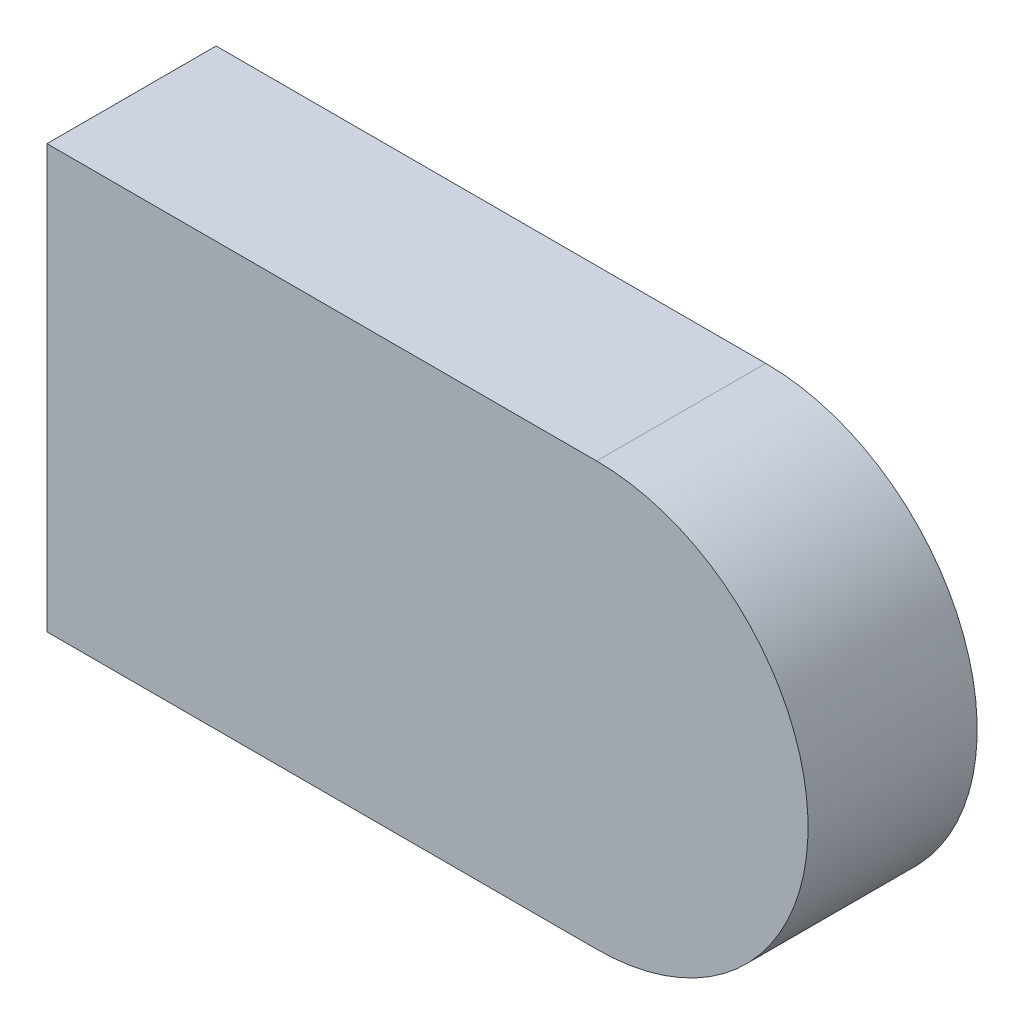
ISO-10303-21;
HEADER;
FILE_DESCRIPTION(('STEP AP214'),'2;1');
FILE_NAME('part.step','',(''),(''),'','','');
FILE_SCHEMA(('AUTOMOTIVE_DESIGN { 1 0 10303 214 1 1 1 1 }'));
ENDSEC;
DATA;
#1=APPLICATION_CONTEXT('core data for automotive mechanical design processes');
#2=APPLICATION_PROTOCOL_DEFINITION('international standard','automotive_design',2000,#1);
#3=PRODUCT_CONTEXT('',#1,'mechanical');
#4=PRODUCT('Part','Part','',(#3));
#5=PRODUCT_RELATED_PRODUCT_CATEGORY('part','',(#4));
#6=PRODUCT_DEFINITION_FORMATION('','',#4);
#7=PRODUCT_DEFINITION_CONTEXT('part definition',#1,'design');
#8=PRODUCT_DEFINITION('design','',#6,#7);
#9=PRODUCT_DEFINITION_SHAPE('','',#8);
#10=(LENGTH_UNIT() NAMED_UNIT(*) SI_UNIT(.MILLI.,.METRE.));
#11=(NAMED_UNIT(*) PLANE_ANGLE_UNIT() SI_UNIT($,.RADIAN.));
#12=(NAMED_UNIT(*) SI_UNIT($,.STERADIAN.) SOLID_ANGLE_UNIT());
#13=UNCERTAINTY_MEASURE_WITH_UNIT(LENGTH_MEASURE(1.E-05),#10,'distance_accuracy_value','');
#14=(GEOMETRIC_REPRESENTATION_CONTEXT(3) GLOBAL_UNCERTAINTY_ASSIGNED_CONTEXT((#13)) GLOBAL_UNIT_ASSIGNED_CONTEXT((#10,
#11,#12)) REPRESENTATION_CONTEXT('',''));
#15=CARTESIAN_POINT('',(0.,0.,0.));
#16=DIRECTION('',(0.,0.,1.));
#17=DIRECTION('',(1.,0.,0.));
#18=AXIS2_PLACEMENT_3D('',#15,#16,#17);
#19=CARTESIAN_POINT('',(-2.05,-0.375,0.));
#20=DIRECTION('',(0.,1.,0.));
#21=DIRECTION('',(1.,0.,0.));
#22=AXIS2_PLACEMENT_3D('',#19,#20,#21);
#23=PLANE('',#22);
#24=DIRECTION('',(1.,0.,0.));
#25=VECTOR('',#24,1.);
#26=CARTESIAN_POINT('',(-2.05,-0.375,0.));
#27=LINE('',#26,#25);
#28=CARTESIAN_POINT('',(-2.05,-0.375,0.));
#29=VERTEX_POINT('',#28);
#30=CARTESIAN_POINT('',(-1.725,-0.375,0.));
#31=VERTEX_POINT('',#30);
#32=EDGE_CURVE('E11',#29,#31,#27,.T.);
#33=ORIENTED_EDGE('',*,*,#32,.T.);
#34=DIRECTION('',(0.,0.,1.));
#35=VECTOR('',#34,1.);
#36=CARTESIAN_POINT('',(-1.725,-0.375,0.));
#37=LINE('',#36,#35);
#38=CARTESIAN_POINT('',(-1.725,-0.375,0.1));
#39=VERTEX_POINT('',#38);
#40=EDGE_CURVE('E24',#31,#39,#37,.T.);
#41=ORIENTED_EDGE('',*,*,#40,.T.);
#42=DIRECTION('',(1.,0.,0.));
#43=VECTOR('',#42,1.);
#44=CARTESIAN_POINT('',(-2.05,-0.375,0.1));
#45=LINE('',#44,#43);
#46=CARTESIAN_POINT('',(-2.05,-0.375,0.1));
#47=VERTEX_POINT('',#46);
#48=EDGE_CURVE('E88',#47,#39,#45,.T.);
#49=ORIENTED_EDGE('',*,*,#48,.F.);
#50=DIRECTION('',(0.,0.,1.));
#51=VECTOR('',#50,1.);
#52=CARTESIAN_POINT('',(-2.05,-0.375,0.));
#53=LINE('',#52,#51);
#54=EDGE_CURVE('E36',#29,#47,#53,.T.);
#55=ORIENTED_EDGE('',*,*,#54,.F.);
#56=EDGE_LOOP('',(#33,#41,#49,#55));
#57=FACE_BOUND('',#56,.T.);
#58=ADVANCED_FACE('F17',(#57),#23,.F.);
#59=CARTESIAN_POINT('',(-1.725,-0.25,0.));
#60=DIRECTION('',(0.,0.,-1.));
#61=DIRECTION('',(1.,0.,0.));
#62=AXIS2_PLACEMENT_3D('',#59,#60,#61);
#63=CYLINDRICAL_SURFACE('',#62,0.125);
#64=CARTESIAN_POINT('',(-1.725,-0.25,0.));
#65=DIRECTION('',(0.,0.,1.));
#66=DIRECTION('',(1.,0.,0.));
#67=AXIS2_PLACEMENT_3D('',#64,#65,#66);
#68=CIRCLE('',#67,0.125);
#69=CARTESIAN_POINT('',(-1.725,-0.125,0.));
#70=VERTEX_POINT('',#69);
#71=EDGE_CURVE('E85',#31,#70,#68,.T.);
#72=ORIENTED_EDGE('',*,*,#71,.T.);
#73=DIRECTION('',(0.,0.,1.));
#74=VECTOR('',#73,1.);
#75=CARTESIAN_POINT('',(-1.725,-0.125,0.));
#76=LINE('',#75,#74);
#77=CARTESIAN_POINT('',(-1.725,-0.125,0.1));
#78=VERTEX_POINT('',#77);
#79=EDGE_CURVE('E73',#70,#78,#76,.T.);
#80=ORIENTED_EDGE('',*,*,#79,.T.);
#81=CARTESIAN_POINT('',(-1.725,-0.25,0.1));
#82=DIRECTION('',(0.,0.,1.));
#83=DIRECTION('',(1.,0.,0.));
#84=AXIS2_PLACEMENT_3D('',#81,#82,#83);
#85=CIRCLE('',#84,0.125);
#86=EDGE_CURVE('E66',#39,#78,#85,.T.);
#87=ORIENTED_EDGE('',*,*,#86,.F.);
#88=ORIENTED_EDGE('',*,*,#40,.F.);
#89=EDGE_LOOP('',(#72,#80,#87,#88));
#90=FACE_BOUND('',#89,.T.);
#91=ADVANCED_FACE('F89',(#90),#63,.T.);
#92=CARTESIAN_POINT('',(-2.05,-0.125,0.));
#93=DIRECTION('',(0.,1.,0.));
#94=DIRECTION('',(1.,0.,0.));
#95=AXIS2_PLACEMENT_3D('',#92,#93,#94);
#96=PLANE('',#95);
#97=DIRECTION('',(0.,0.,1.));
#98=VECTOR('',#97,1.);
#99=CARTESIAN_POINT('',(-2.05,-0.125,0.));
#100=LINE('',#99,#98);
#101=CARTESIAN_POINT('',(-2.05,-0.125,0.));
#102=VERTEX_POINT('',#101);
#103=CARTESIAN_POINT('',(-2.05,-0.125,0.1));
#104=VERTEX_POINT('',#103);
#105=EDGE_CURVE('E56',#102,#104,#100,.T.);
#106=ORIENTED_EDGE('',*,*,#105,.T.);
#107=DIRECTION('',(1.,0.,0.));
#108=VECTOR('',#107,1.);
#109=CARTESIAN_POINT('',(-2.05,-0.125,0.1));
#110=LINE('',#109,#108);
#111=EDGE_CURVE('E67',#104,#78,#110,.T.);
#112=ORIENTED_EDGE('',*,*,#111,.T.);
#113=ORIENTED_EDGE('',*,*,#79,.F.);
#114=DIRECTION('',(1.,0.,0.));
#115=VECTOR('',#114,1.);
#116=CARTESIAN_POINT('',(-2.05,-0.125,0.));
#117=LINE('',#116,#115);
#118=EDGE_CURVE('E71',#102,#70,#117,.T.);
#119=ORIENTED_EDGE('',*,*,#118,.F.);
#120=EDGE_LOOP('',(#106,#112,#113,#119));
#121=FACE_BOUND('',#120,.T.);
#122=ADVANCED_FACE('F72',(#121),#96,.T.);
#123=CARTESIAN_POINT('',(-2.05,-0.375,0.));
#124=DIRECTION('',(-1.,0.,0.));
#125=DIRECTION('',(0.,1.,0.));
#126=AXIS2_PLACEMENT_3D('',#123,#124,#125);
#127=PLANE('',#126);
#128=ORIENTED_EDGE('',*,*,#54,.T.);
#129=DIRECTION('',(0.,1.,0.));
#130=VECTOR('',#129,1.);
#131=CARTESIAN_POINT('',(-2.05,-0.375,0.1));
#132=LINE('',#131,#130);
#133=EDGE_CURVE('E62',#47,#104,#132,.T.);
#134=ORIENTED_EDGE('',*,*,#133,.T.);
#135=ORIENTED_EDGE('',*,*,#105,.F.);
#136=DIRECTION('',(0.,1.,0.));
#137=VECTOR('',#136,1.);
#138=CARTESIAN_POINT('',(-2.05,-0.375,0.));
#139=LINE('',#138,#137);
#140=EDGE_CURVE('E60',#29,#102,#139,.T.);
#141=ORIENTED_EDGE('',*,*,#140,.F.);
#142=EDGE_LOOP('',(#128,#134,#135,#141));
#143=FACE_BOUND('',#142,.T.);
#144=ADVANCED_FACE('F58',(#143),#127,.T.);
#145=CARTESIAN_POINT('',(-1.850342514613,-0.25,0.));
#146=DIRECTION('',(0.,0.,1.));
#147=DIRECTION('',(1.,0.,0.));
#148=AXIS2_PLACEMENT_3D('',#145,#146,#147);
#149=PLANE('',#148);
#150=ORIENTED_EDGE('',*,*,#140,.T.);
#151=ORIENTED_EDGE('',*,*,#118,.T.);
#152=ORIENTED_EDGE('',*,*,#71,.F.);
#153=ORIENTED_EDGE('',*,*,#32,.F.);
#154=EDGE_LOOP('',(#150,#151,#152,#153));
#155=FACE_BOUND('',#154,.T.);
#156=ADVANCED_FACE('F77',(#155),#149,.F.);
#157=CARTESIAN_POINT('',(-1.850342514613,-0.25,0.1));
#158=DIRECTION('',(0.,0.,1.));
#159=DIRECTION('',(1.,0.,0.));
#160=AXIS2_PLACEMENT_3D('',#157,#158,#159);
#161=PLANE('',#160);
#162=ORIENTED_EDGE('',*,*,#48,.T.);
#163=ORIENTED_EDGE('',*,*,#86,.T.);
#164=ORIENTED_EDGE('',*,*,#111,.F.);
#165=ORIENTED_EDGE('',*,*,#133,.F.);
#166=EDGE_LOOP('',(#162,#163,#164,#165));
#167=FACE_BOUND('',#166,.T.);
#168=ADVANCED_FACE('F91',(#167),#161,.T.);
#169=CLOSED_SHELL('',(#58,#91,#122,#144,#156,#168));
#170=MANIFOLD_SOLID_BREP('B1',#169);
#171=ADVANCED_BREP_SHAPE_REPRESENTATION('',(#18,#170),#14);
#172=SHAPE_DEFINITION_REPRESENTATION(#9,#171);
ENDSEC;
END-ISO-10303-21;
